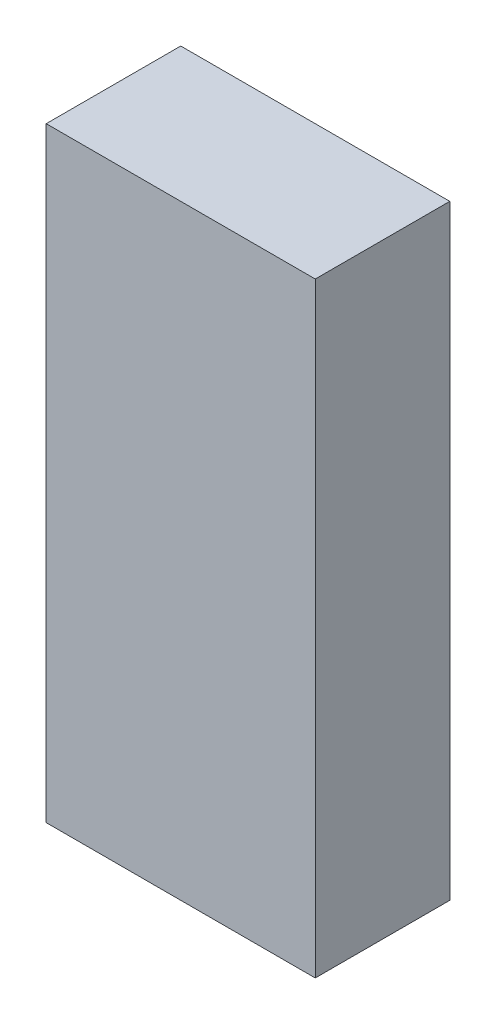
ISO-10303-21;
HEADER;
FILE_DESCRIPTION(('STEP AP214'),'2;1');
FILE_NAME('part.step','',(''),(''),'','','');
FILE_SCHEMA(('AUTOMOTIVE_DESIGN { 1 0 10303 214 1 1 1 1 }'));
ENDSEC;
DATA;
#1=APPLICATION_CONTEXT('core data for automotive mechanical design processes');
#2=APPLICATION_PROTOCOL_DEFINITION('international standard','automotive_design',2000,#1);
#3=PRODUCT_CONTEXT('',#1,'mechanical');
#4=PRODUCT('Part','Part','',(#3));
#5=PRODUCT_RELATED_PRODUCT_CATEGORY('part','',(#4));
#6=PRODUCT_DEFINITION_FORMATION('','',#4);
#7=PRODUCT_DEFINITION_CONTEXT('part definition',#1,'design');
#8=PRODUCT_DEFINITION('design','',#6,#7);
#9=PRODUCT_DEFINITION_SHAPE('','',#8);
#10=(LENGTH_UNIT() NAMED_UNIT(*) SI_UNIT(.MILLI.,.METRE.));
#11=(NAMED_UNIT(*) PLANE_ANGLE_UNIT() SI_UNIT($,.RADIAN.));
#12=(NAMED_UNIT(*) SI_UNIT($,.STERADIAN.) SOLID_ANGLE_UNIT());
#13=UNCERTAINTY_MEASURE_WITH_UNIT(LENGTH_MEASURE(1.E-05),#10,'distance_accuracy_value','');
#14=(GEOMETRIC_REPRESENTATION_CONTEXT(3) GLOBAL_UNCERTAINTY_ASSIGNED_CONTEXT((#13)) GLOBAL_UNIT_ASSIGNED_CONTEXT((#10,
#11,#12)) REPRESENTATION_CONTEXT('',''));
#15=CARTESIAN_POINT('',(0.,0.,0.));
#16=DIRECTION('',(0.,0.,1.));
#17=DIRECTION('',(1.,0.,0.));
#18=AXIS2_PLACEMENT_3D('',#15,#16,#17);
#19=CARTESIAN_POINT('',(0.4,-2.975,0.));
#20=DIRECTION('',(1.,0.,0.));
#21=DIRECTION('',(0.,0.,1.));
#22=AXIS2_PLACEMENT_3D('',#19,#20,#21);
#23=PLANE('',#22);
#24=DIRECTION('',(0.,1.,0.));
#25=VECTOR('',#24,1.);
#26=CARTESIAN_POINT('',(0.4,-2.975,0.1));
#27=LINE('',#26,#25);
#28=CARTESIAN_POINT('',(0.4,-2.975,0.1));
#29=VERTEX_POINT('',#28);
#30=CARTESIAN_POINT('',(0.4,-2.525,0.1));
#31=VERTEX_POINT('',#30);
#32=EDGE_CURVE('E11',#29,#31,#27,.T.);
#33=ORIENTED_EDGE('',*,*,#32,.T.);
#34=DIRECTION('',(0.,0.,1.));
#35=VECTOR('',#34,1.);
#36=CARTESIAN_POINT('',(0.4,-2.525,0.));
#37=LINE('',#36,#35);
#38=CARTESIAN_POINT('',(0.4,-2.525,0.));
#39=VERTEX_POINT('',#38);
#40=EDGE_CURVE('E24',#39,#31,#37,.T.);
#41=ORIENTED_EDGE('',*,*,#40,.F.);
#42=DIRECTION('',(0.,1.,0.));
#43=VECTOR('',#42,1.);
#44=CARTESIAN_POINT('',(0.4,-2.975,0.));
#45=LINE('',#44,#43);
#46=CARTESIAN_POINT('',(0.4,-2.975,0.));
#47=VERTEX_POINT('',#46);
#48=EDGE_CURVE('E86',#47,#39,#45,.T.);
#49=ORIENTED_EDGE('',*,*,#48,.F.);
#50=DIRECTION('',(0.,0.,1.));
#51=VECTOR('',#50,1.);
#52=CARTESIAN_POINT('',(0.4,-2.975,0.));
#53=LINE('',#52,#51);
#54=EDGE_CURVE('E36',#47,#29,#53,.T.);
#55=ORIENTED_EDGE('',*,*,#54,.T.);
#56=EDGE_LOOP('',(#33,#41,#49,#55));
#57=FACE_BOUND('',#56,.T.);
#58=ADVANCED_FACE('F17',(#57),#23,.F.);
#59=CARTESIAN_POINT('',(0.6,-2.975,0.));
#60=DIRECTION('',(1.,0.,0.));
#61=DIRECTION('',(0.,0.,1.));
#62=AXIS2_PLACEMENT_3D('',#59,#60,#61);
#63=PLANE('',#62);
#64=DIRECTION('',(0.,0.,1.));
#65=VECTOR('',#64,1.);
#66=CARTESIAN_POINT('',(0.6,-2.975,0.));
#67=LINE('',#66,#65);
#68=CARTESIAN_POINT('',(0.6,-2.975,0.));
#69=VERTEX_POINT('',#68);
#70=CARTESIAN_POINT('',(0.6,-2.975,0.1));
#71=VERTEX_POINT('',#70);
#72=EDGE_CURVE('E83',#69,#71,#67,.T.);
#73=ORIENTED_EDGE('',*,*,#72,.F.);
#74=DIRECTION('',(0.,1.,0.));
#75=VECTOR('',#74,1.);
#76=CARTESIAN_POINT('',(0.6,-2.975,0.));
#77=LINE('',#76,#75);
#78=CARTESIAN_POINT('',(0.6,-2.525,0.));
#79=VERTEX_POINT('',#78);
#80=EDGE_CURVE('E63',#69,#79,#77,.T.);
#81=ORIENTED_EDGE('',*,*,#80,.T.);
#82=DIRECTION('',(0.,0.,1.));
#83=VECTOR('',#82,1.);
#84=CARTESIAN_POINT('',(0.6,-2.525,0.));
#85=LINE('',#84,#83);
#86=CARTESIAN_POINT('',(0.6,-2.525,0.1));
#87=VERTEX_POINT('',#86);
#88=EDGE_CURVE('E57',#79,#87,#85,.T.);
#89=ORIENTED_EDGE('',*,*,#88,.T.);
#90=DIRECTION('',(0.,1.,0.));
#91=VECTOR('',#90,1.);
#92=CARTESIAN_POINT('',(0.6,-2.975,0.1));
#93=LINE('',#92,#91);
#94=EDGE_CURVE('E60',#71,#87,#93,.T.);
#95=ORIENTED_EDGE('',*,*,#94,.F.);
#96=EDGE_LOOP('',(#73,#81,#89,#95));
#97=FACE_BOUND('',#96,.T.);
#98=ADVANCED_FACE('F59',(#97),#63,.T.);
#99=CARTESIAN_POINT('',(0.4,-2.975,0.));
#100=DIRECTION('',(0.,1.,0.));
#101=DIRECTION('',(0.,0.,1.));
#102=AXIS2_PLACEMENT_3D('',#99,#100,#101);
#103=PLANE('',#102);
#104=ORIENTED_EDGE('',*,*,#72,.T.);
#105=DIRECTION('',(1.,0.,0.));
#106=VECTOR('',#105,1.);
#107=CARTESIAN_POINT('',(0.4,-2.975,0.1));
#108=LINE('',#107,#106);
#109=EDGE_CURVE('E71',#29,#71,#108,.T.);
#110=ORIENTED_EDGE('',*,*,#109,.F.);
#111=ORIENTED_EDGE('',*,*,#54,.F.);
#112=DIRECTION('',(1.,0.,0.));
#113=VECTOR('',#112,1.);
#114=CARTESIAN_POINT('',(0.4,-2.975,0.));
#115=LINE('',#114,#113);
#116=EDGE_CURVE('E76',#47,#69,#115,.T.);
#117=ORIENTED_EDGE('',*,*,#116,.T.);
#118=EDGE_LOOP('',(#104,#110,#111,#117));
#119=FACE_BOUND('',#118,.T.);
#120=ADVANCED_FACE('F91',(#119),#103,.F.);
#121=CARTESIAN_POINT('',(0.4,-2.525,0.));
#122=DIRECTION('',(0.,1.,0.));
#123=DIRECTION('',(0.,0.,1.));
#124=AXIS2_PLACEMENT_3D('',#121,#122,#123);
#125=PLANE('',#124);
#126=DIRECTION('',(1.,0.,0.));
#127=VECTOR('',#126,1.);
#128=CARTESIAN_POINT('',(0.4,-2.525,0.));
#129=LINE('',#128,#127);
#130=EDGE_CURVE('E74',#39,#79,#129,.T.);
#131=ORIENTED_EDGE('',*,*,#130,.F.);
#132=ORIENTED_EDGE('',*,*,#40,.T.);
#133=DIRECTION('',(1.,0.,0.));
#134=VECTOR('',#133,1.);
#135=CARTESIAN_POINT('',(0.4,-2.525,0.1));
#136=LINE('',#135,#134);
#137=EDGE_CURVE('E69',#31,#87,#136,.T.);
#138=ORIENTED_EDGE('',*,*,#137,.T.);
#139=ORIENTED_EDGE('',*,*,#88,.F.);
#140=EDGE_LOOP('',(#131,#132,#138,#139));
#141=FACE_BOUND('',#140,.T.);
#142=ADVANCED_FACE('F73',(#141),#125,.T.);
#143=CARTESIAN_POINT('',(0.4,-2.975,0.));
#144=DIRECTION('',(0.,0.,1.));
#145=DIRECTION('',(1.,0.,0.));
#146=AXIS2_PLACEMENT_3D('',#143,#144,#145);
#147=PLANE('',#146);
#148=ORIENTED_EDGE('',*,*,#130,.T.);
#149=ORIENTED_EDGE('',*,*,#80,.F.);
#150=ORIENTED_EDGE('',*,*,#116,.F.);
#151=ORIENTED_EDGE('',*,*,#48,.T.);
#152=EDGE_LOOP('',(#148,#149,#150,#151));
#153=FACE_BOUND('',#152,.T.);
#154=ADVANCED_FACE('F89',(#153),#147,.F.);
#155=CARTESIAN_POINT('',(0.4,-2.975,0.1));
#156=DIRECTION('',(0.,0.,1.));
#157=DIRECTION('',(1.,0.,0.));
#158=AXIS2_PLACEMENT_3D('',#155,#156,#157);
#159=PLANE('',#158);
#160=ORIENTED_EDGE('',*,*,#32,.F.);
#161=ORIENTED_EDGE('',*,*,#109,.T.);
#162=ORIENTED_EDGE('',*,*,#94,.T.);
#163=ORIENTED_EDGE('',*,*,#137,.F.);
#164=EDGE_LOOP('',(#160,#161,#162,#163));
#165=FACE_BOUND('',#164,.T.);
#166=ADVANCED_FACE('F68',(#165),#159,.T.);
#167=CLOSED_SHELL('',(#58,#98,#120,#142,#154,#166));
#168=MANIFOLD_SOLID_BREP('B1',#167);
#169=ADVANCED_BREP_SHAPE_REPRESENTATION('',(#18,#168),#14);
#170=SHAPE_DEFINITION_REPRESENTATION(#9,#169);
ENDSEC;
END-ISO-10303-21;
